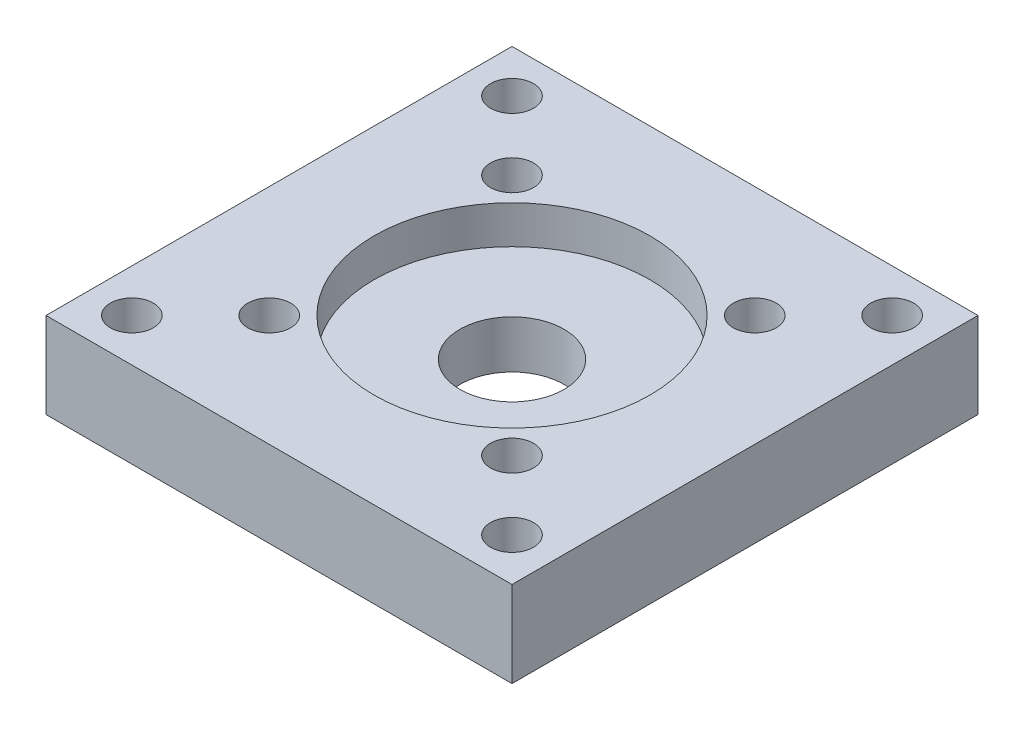
ISO-10303-21;
HEADER;
FILE_DESCRIPTION(('STEP AP214'),'2;1');
FILE_NAME('part.step','',(''),(''),'','','');
FILE_SCHEMA(('AUTOMOTIVE_DESIGN { 1 0 10303 214 1 1 1 1 }'));
ENDSEC;
DATA;
#1=APPLICATION_CONTEXT('core data for automotive mechanical design processes');
#2=APPLICATION_PROTOCOL_DEFINITION('international standard','automotive_design',2000,#1);
#3=PRODUCT_CONTEXT('',#1,'mechanical');
#4=PRODUCT('Part','Part','',(#3));
#5=PRODUCT_RELATED_PRODUCT_CATEGORY('part','',(#4));
#6=PRODUCT_DEFINITION_FORMATION('','',#4);
#7=PRODUCT_DEFINITION_CONTEXT('part definition',#1,'design');
#8=PRODUCT_DEFINITION('design','',#6,#7);
#9=PRODUCT_DEFINITION_SHAPE('','',#8);
#10=(LENGTH_UNIT() NAMED_UNIT(*) SI_UNIT(.MILLI.,.METRE.));
#11=(NAMED_UNIT(*) PLANE_ANGLE_UNIT() SI_UNIT($,.RADIAN.));
#12=(NAMED_UNIT(*) SI_UNIT($,.STERADIAN.) SOLID_ANGLE_UNIT());
#13=UNCERTAINTY_MEASURE_WITH_UNIT(LENGTH_MEASURE(1.E-05),#10,'distance_accuracy_value','');
#14=(GEOMETRIC_REPRESENTATION_CONTEXT(3) GLOBAL_UNCERTAINTY_ASSIGNED_CONTEXT((#13)) GLOBAL_UNIT_ASSIGNED_CONTEXT((#10,
#11,#12)) REPRESENTATION_CONTEXT('',''));
#15=CARTESIAN_POINT('',(0.,0.,0.));
#16=DIRECTION('',(0.,0.,1.));
#17=DIRECTION('',(1.,0.,0.));
#18=AXIS2_PLACEMENT_3D('',#15,#16,#17);
#19=CARTESIAN_POINT('',(-9.89949493661172,-20.,-9.89949493661161));
#20=DIRECTION('',(0.,1.,0.));
#21=DIRECTION('',(0.,0.,1.));
#22=AXIS2_PLACEMENT_3D('',#19,#20,#21);
#23=CYLINDRICAL_SURFACE('',#22,1.75);
#24=CARTESIAN_POINT('',(-9.89949493661172,7.,-9.89949493661161));
#25=DIRECTION('',(0.,1.,0.));
#26=DIRECTION('',(0.,0.,1.));
#27=AXIS2_PLACEMENT_3D('',#24,#25,#26);
#28=CIRCLE('',#27,1.75);
#29=CARTESIAN_POINT('',(-9.89949493661172,7.,-8.14949493661161));
#30=VERTEX_POINT('',#29);
#31=EDGE_CURVE('E147',#30,#30,#28,.T.);
#32=ORIENTED_EDGE('',*,*,#31,.T.);
#33=EDGE_LOOP('',(#32));
#34=FACE_BOUND('',#33,.T.);
#35=CARTESIAN_POINT('',(-9.89949493661172,3.5,-9.89949493661161));
#36=DIRECTION('',(0.,-1.,0.));
#37=DIRECTION('',(0.,0.,-1.));
#38=AXIS2_PLACEMENT_3D('',#35,#36,#37);
#39=CIRCLE('',#38,1.75);
#40=CARTESIAN_POINT('',(-9.89949493661172,3.5,-11.6494949366116));
#41=VERTEX_POINT('',#40);
#42=EDGE_CURVE('E171',#41,#41,#39,.T.);
#43=ORIENTED_EDGE('',*,*,#42,.T.);
#44=EDGE_LOOP('',(#43));
#45=FACE_BOUND('',#44,.T.);
#46=ADVANCED_FACE('F37',(#34,#45),#23,.F.);
#47=CARTESIAN_POINT('',(9.89949493661165,-20.,-9.89949493661168));
#48=DIRECTION('',(0.,1.,0.));
#49=DIRECTION('',(0.,0.,1.));
#50=AXIS2_PLACEMENT_3D('',#47,#48,#49);
#51=CYLINDRICAL_SURFACE('',#50,1.75);
#52=CARTESIAN_POINT('',(9.89949493661165,7.,-9.89949493661168));
#53=DIRECTION('',(0.,1.,0.));
#54=DIRECTION('',(0.,0.,1.));
#55=AXIS2_PLACEMENT_3D('',#52,#53,#54);
#56=CIRCLE('',#55,1.75);
#57=CARTESIAN_POINT('',(9.89949493661165,7.,-8.14949493661168));
#58=VERTEX_POINT('',#57);
#59=EDGE_CURVE('E152',#58,#58,#56,.T.);
#60=ORIENTED_EDGE('',*,*,#59,.T.);
#61=EDGE_LOOP('',(#60));
#62=FACE_BOUND('',#61,.T.);
#63=CARTESIAN_POINT('',(9.89949493661165,3.5,-9.89949493661168));
#64=DIRECTION('',(0.,-1.,0.));
#65=DIRECTION('',(0.,0.,-1.));
#66=AXIS2_PLACEMENT_3D('',#63,#64,#65);
#67=CIRCLE('',#66,1.75);
#68=CARTESIAN_POINT('',(9.89949493661165,3.5,-11.6494949366117));
#69=VERTEX_POINT('',#68);
#70=EDGE_CURVE('E181',#69,#69,#67,.T.);
#71=ORIENTED_EDGE('',*,*,#70,.T.);
#72=EDGE_LOOP('',(#71));
#73=FACE_BOUND('',#72,.T.);
#74=ADVANCED_FACE('F235',(#62,#73),#51,.F.);
#75=CARTESIAN_POINT('',(9.89949493661179,-20.,9.89949493661154));
#76=DIRECTION('',(0.,1.,0.));
#77=DIRECTION('',(0.,0.,1.));
#78=AXIS2_PLACEMENT_3D('',#75,#76,#77);
#79=CYLINDRICAL_SURFACE('',#78,1.75);
#80=CARTESIAN_POINT('',(9.89949493661179,7.,9.89949493661154));
#81=DIRECTION('',(0.,1.,0.));
#82=DIRECTION('',(0.,0.,1.));
#83=AXIS2_PLACEMENT_3D('',#80,#81,#82);
#84=CIRCLE('',#83,1.75);
#85=CARTESIAN_POINT('',(9.89949493661179,7.,11.6494949366115));
#86=VERTEX_POINT('',#85);
#87=EDGE_CURVE('E156',#86,#86,#84,.T.);
#88=ORIENTED_EDGE('',*,*,#87,.T.);
#89=EDGE_LOOP('',(#88));
#90=FACE_BOUND('',#89,.T.);
#91=CARTESIAN_POINT('',(9.89949493661179,3.5,9.89949493661154));
#92=DIRECTION('',(0.,-1.,0.));
#93=DIRECTION('',(0.,0.,-1.));
#94=AXIS2_PLACEMENT_3D('',#91,#92,#93);
#95=CIRCLE('',#94,1.75);
#96=CARTESIAN_POINT('',(9.89949493661179,3.5,8.14949493661155));
#97=VERTEX_POINT('',#96);
#98=EDGE_CURVE('E170',#97,#97,#95,.T.);
#99=ORIENTED_EDGE('',*,*,#98,.T.);
#100=EDGE_LOOP('',(#99));
#101=FACE_BOUND('',#100,.T.);
#102=ADVANCED_FACE('F241',(#90,#101),#79,.F.);
#103=CARTESIAN_POINT('',(-9.89949493661158,-20.,9.89949493661175));
#104=DIRECTION('',(0.,1.,0.));
#105=DIRECTION('',(0.,0.,1.));
#106=AXIS2_PLACEMENT_3D('',#103,#104,#105);
#107=CYLINDRICAL_SURFACE('',#106,1.75);
#108=CARTESIAN_POINT('',(-9.89949493661158,7.,9.89949493661175));
#109=DIRECTION('',(0.,1.,0.));
#110=DIRECTION('',(0.,0.,1.));
#111=AXIS2_PLACEMENT_3D('',#108,#109,#110);
#112=CIRCLE('',#111,1.75);
#113=CARTESIAN_POINT('',(-9.89949493661158,7.,11.6494949366118));
#114=VERTEX_POINT('',#113);
#115=EDGE_CURVE('E153',#114,#114,#112,.T.);
#116=ORIENTED_EDGE('',*,*,#115,.T.);
#117=EDGE_LOOP('',(#116));
#118=FACE_BOUND('',#117,.T.);
#119=CARTESIAN_POINT('',(-9.89949493661158,3.5,9.89949493661175));
#120=DIRECTION('',(0.,-1.,0.));
#121=DIRECTION('',(0.,0.,-1.));
#122=AXIS2_PLACEMENT_3D('',#119,#120,#121);
#123=CIRCLE('',#122,1.75);
#124=CARTESIAN_POINT('',(-9.89949493661158,3.5,8.14949493661175));
#125=VERTEX_POINT('',#124);
#126=EDGE_CURVE('E165',#125,#125,#123,.T.);
#127=ORIENTED_EDGE('',*,*,#126,.T.);
#128=EDGE_LOOP('',(#127));
#129=FACE_BOUND('',#128,.T.);
#130=ADVANCED_FACE('F247',(#118,#129),#107,.F.);
#131=CARTESIAN_POINT('',(0.,0.,0.));
#132=DIRECTION('',(0.,1.,0.));
#133=DIRECTION('',(0.,0.,1.));
#134=AXIS2_PLACEMENT_3D('',#131,#132,#133);
#135=CYLINDRICAL_SURFACE('',#134,4.25);
#136=CARTESIAN_POINT('',(0.,0.,0.));
#137=DIRECTION('',(0.,1.,0.));
#138=DIRECTION('',(0.,0.,1.));
#139=AXIS2_PLACEMENT_3D('',#136,#137,#138);
#140=CIRCLE('',#139,4.25);
#141=CARTESIAN_POINT('',(0.,0.,4.24999999999999));
#142=VERTEX_POINT('',#141);
#143=EDGE_CURVE('E123',#142,#142,#140,.T.);
#144=ORIENTED_EDGE('',*,*,#143,.F.);
#145=EDGE_LOOP('',(#144));
#146=FACE_BOUND('',#145,.T.);
#147=CARTESIAN_POINT('',(0.,3.9,0.));
#148=DIRECTION('',(0.,1.,0.));
#149=DIRECTION('',(0.,0.,1.));
#150=AXIS2_PLACEMENT_3D('',#147,#148,#149);
#151=CIRCLE('',#150,4.25);
#152=CARTESIAN_POINT('',(0.,3.9,4.24999999999999));
#153=VERTEX_POINT('',#152);
#154=EDGE_CURVE('E41',#153,#153,#151,.F.);
#155=ORIENTED_EDGE('',*,*,#154,.F.);
#156=EDGE_LOOP('',(#155));
#157=FACE_BOUND('',#156,.T.);
#158=ADVANCED_FACE('F269',(#146,#157),#135,.F.);
#159=CARTESIAN_POINT('',(19.,7.,19.));
#160=DIRECTION('',(-1.,0.,0.));
#161=DIRECTION('',(0.,0.,1.));
#162=AXIS2_PLACEMENT_3D('',#159,#160,#161);
#163=PLANE('',#162);
#164=DIRECTION('',(0.,0.,-1.));
#165=VECTOR('',#164,1.);
#166=CARTESIAN_POINT('',(19.,0.,19.));
#167=LINE('',#166,#165);
#168=CARTESIAN_POINT('',(19.,0.,19.));
#169=VERTEX_POINT('',#168);
#170=CARTESIAN_POINT('',(19.,0.,-19.));
#171=VERTEX_POINT('',#170);
#172=EDGE_CURVE('E103',#169,#171,#167,.T.);
#173=ORIENTED_EDGE('',*,*,#172,.T.);
#174=DIRECTION('',(0.,-1.,0.));
#175=VECTOR('',#174,1.);
#176=CARTESIAN_POINT('',(19.,7.,-19.));
#177=LINE('',#176,#175);
#178=CARTESIAN_POINT('',(19.,7.,-19.));
#179=VERTEX_POINT('',#178);
#180=EDGE_CURVE('E11',#179,#171,#177,.T.);
#181=ORIENTED_EDGE('',*,*,#180,.F.);
#182=DIRECTION('',(0.,0.,-1.));
#183=VECTOR('',#182,1.);
#184=CARTESIAN_POINT('',(19.,7.,19.));
#185=LINE('',#184,#183);
#186=CARTESIAN_POINT('',(19.,7.,19.));
#187=VERTEX_POINT('',#186);
#188=EDGE_CURVE('E90',#187,#179,#185,.T.);
#189=ORIENTED_EDGE('',*,*,#188,.F.);
#190=DIRECTION('',(0.,-1.,0.));
#191=VECTOR('',#190,1.);
#192=CARTESIAN_POINT('',(19.,7.,19.));
#193=LINE('',#192,#191);
#194=EDGE_CURVE('E99',#187,#169,#193,.T.);
#195=ORIENTED_EDGE('',*,*,#194,.T.);
#196=EDGE_LOOP('',(#173,#181,#189,#195));
#197=FACE_BOUND('',#196,.T.);
#198=ADVANCED_FACE('F39',(#197),#163,.F.);
#199=CARTESIAN_POINT('',(-19.,7.,-19.));
#200=DIRECTION('',(0.,0.,1.));
#201=DIRECTION('',(1.,0.,0.));
#202=AXIS2_PLACEMENT_3D('',#199,#200,#201);
#203=PLANE('',#202);
#204=DIRECTION('',(-1.,0.,0.));
#205=VECTOR('',#204,1.);
#206=CARTESIAN_POINT('',(-19.,0.,-19.));
#207=LINE('',#206,#205);
#208=CARTESIAN_POINT('',(-19.,0.,-19.));
#209=VERTEX_POINT('',#208);
#210=EDGE_CURVE('E94',#171,#209,#207,.T.);
#211=ORIENTED_EDGE('',*,*,#210,.T.);
#212=DIRECTION('',(0.,-1.,0.));
#213=VECTOR('',#212,1.);
#214=CARTESIAN_POINT('',(-19.,7.,-19.));
#215=LINE('',#214,#213);
#216=CARTESIAN_POINT('',(-19.,7.,-19.));
#217=VERTEX_POINT('',#216);
#218=EDGE_CURVE('E47',#217,#209,#215,.T.);
#219=ORIENTED_EDGE('',*,*,#218,.F.);
#220=DIRECTION('',(-1.,0.,0.));
#221=VECTOR('',#220,1.);
#222=CARTESIAN_POINT('',(-19.,7.,-19.));
#223=LINE('',#222,#221);
#224=EDGE_CURVE('E85',#179,#217,#223,.T.);
#225=ORIENTED_EDGE('',*,*,#224,.F.);
#226=ORIENTED_EDGE('',*,*,#180,.T.);
#227=EDGE_LOOP('',(#211,#219,#225,#226));
#228=FACE_BOUND('',#227,.T.);
#229=ADVANCED_FACE('F93',(#228),#203,.F.);
#230=CARTESIAN_POINT('',(-19.,7.,19.));
#231=DIRECTION('',(1.,0.,0.));
#232=DIRECTION('',(0.,0.,-1.));
#233=AXIS2_PLACEMENT_3D('',#230,#231,#232);
#234=PLANE('',#233);
#235=DIRECTION('',(0.,0.,1.));
#236=VECTOR('',#235,1.);
#237=CARTESIAN_POINT('',(-19.,0.,19.));
#238=LINE('',#237,#236);
#239=CARTESIAN_POINT('',(-19.,0.,19.));
#240=VERTEX_POINT('',#239);
#241=EDGE_CURVE('E72',#209,#240,#238,.T.);
#242=ORIENTED_EDGE('',*,*,#241,.T.);
#243=DIRECTION('',(0.,-1.,0.));
#244=VECTOR('',#243,1.);
#245=CARTESIAN_POINT('',(-19.,7.,19.));
#246=LINE('',#245,#244);
#247=CARTESIAN_POINT('',(-19.,7.,19.));
#248=VERTEX_POINT('',#247);
#249=EDGE_CURVE('E95',#248,#240,#246,.T.);
#250=ORIENTED_EDGE('',*,*,#249,.F.);
#251=DIRECTION('',(0.,0.,1.));
#252=VECTOR('',#251,1.);
#253=CARTESIAN_POINT('',(-19.,7.,19.));
#254=LINE('',#253,#252);
#255=EDGE_CURVE('E88',#217,#248,#254,.T.);
#256=ORIENTED_EDGE('',*,*,#255,.F.);
#257=ORIENTED_EDGE('',*,*,#218,.T.);
#258=EDGE_LOOP('',(#242,#250,#256,#257));
#259=FACE_BOUND('',#258,.T.);
#260=ADVANCED_FACE('F97',(#259),#234,.F.);
#261=CARTESIAN_POINT('',(-19.,7.,19.));
#262=DIRECTION('',(0.,0.,-1.));
#263=DIRECTION('',(-1.,0.,0.));
#264=AXIS2_PLACEMENT_3D('',#261,#262,#263);
#265=PLANE('',#264);
#266=DIRECTION('',(1.,0.,0.));
#267=VECTOR('',#266,1.);
#268=CARTESIAN_POINT('',(-19.,0.,19.));
#269=LINE('',#268,#267);
#270=EDGE_CURVE('E78',#240,#169,#269,.T.);
#271=ORIENTED_EDGE('',*,*,#270,.T.);
#272=ORIENTED_EDGE('',*,*,#194,.F.);
#273=DIRECTION('',(1.,0.,0.));
#274=VECTOR('',#273,1.);
#275=CARTESIAN_POINT('',(-19.,7.,19.));
#276=LINE('',#275,#274);
#277=EDGE_CURVE('E55',#248,#187,#276,.T.);
#278=ORIENTED_EDGE('',*,*,#277,.F.);
#279=ORIENTED_EDGE('',*,*,#249,.T.);
#280=EDGE_LOOP('',(#271,#272,#278,#279));
#281=FACE_BOUND('',#280,.T.);
#282=ADVANCED_FACE('F111',(#281),#265,.F.);
#283=CARTESIAN_POINT('',(0.,7.,0.));
#284=DIRECTION('',(0.,-1.,0.));
#285=DIRECTION('',(0.,0.,-1.));
#286=AXIS2_PLACEMENT_3D('',#283,#284,#285);
#287=PLANE('',#286);
#288=ORIENTED_EDGE('',*,*,#115,.F.);
#289=EDGE_LOOP('',(#288));
#290=FACE_BOUND('',#289,.T.);
#291=ORIENTED_EDGE('',*,*,#87,.F.);
#292=EDGE_LOOP('',(#291));
#293=FACE_BOUND('',#292,.T.);
#294=ORIENTED_EDGE('',*,*,#59,.F.);
#295=EDGE_LOOP('',(#294));
#296=FACE_BOUND('',#295,.T.);
#297=ORIENTED_EDGE('',*,*,#31,.F.);
#298=EDGE_LOOP('',(#297));
#299=FACE_BOUND('',#298,.T.);
#300=CARTESIAN_POINT('',(0.,7.,0.));
#301=DIRECTION('',(0.,1.,0.));
#302=DIRECTION('',(0.,0.,1.));
#303=AXIS2_PLACEMENT_3D('',#300,#301,#302);
#304=CIRCLE('',#303,11.25);
#305=CARTESIAN_POINT('',(0.,7.,11.25));
#306=VERTEX_POINT('',#305);
#307=EDGE_CURVE('E143',#306,#306,#304,.T.);
#308=ORIENTED_EDGE('',*,*,#307,.F.);
#309=EDGE_LOOP('',(#308));
#310=FACE_BOUND('',#309,.T.);
#311=CARTESIAN_POINT('',(15.5,7.,-15.5));
#312=DIRECTION('',(0.,1.,0.));
#313=DIRECTION('',(0.,0.,1.));
#314=AXIS2_PLACEMENT_3D('',#311,#312,#313);
#315=CIRCLE('',#314,1.75);
#316=CARTESIAN_POINT('',(15.5,7.,-13.75));
#317=VERTEX_POINT('',#316);
#318=EDGE_CURVE('E129',#317,#317,#315,.T.);
#319=ORIENTED_EDGE('',*,*,#318,.F.);
#320=EDGE_LOOP('',(#319));
#321=FACE_BOUND('',#320,.T.);
#322=CARTESIAN_POINT('',(15.5,7.,15.5));
#323=DIRECTION('',(0.,1.,0.));
#324=DIRECTION('',(0.,0.,1.));
#325=AXIS2_PLACEMENT_3D('',#322,#323,#324);
#326=CIRCLE('',#325,1.75);
#327=CARTESIAN_POINT('',(15.5,7.,17.25));
#328=VERTEX_POINT('',#327);
#329=EDGE_CURVE('E135',#328,#328,#326,.T.);
#330=ORIENTED_EDGE('',*,*,#329,.F.);
#331=EDGE_LOOP('',(#330));
#332=FACE_BOUND('',#331,.T.);
#333=CARTESIAN_POINT('',(-15.5,7.,15.5));
#334=DIRECTION('',(0.,1.,0.));
#335=DIRECTION('',(0.,0.,1.));
#336=AXIS2_PLACEMENT_3D('',#333,#334,#335);
#337=CIRCLE('',#336,1.75);
#338=CARTESIAN_POINT('',(-15.5,7.,17.25));
#339=VERTEX_POINT('',#338);
#340=EDGE_CURVE('E120',#339,#339,#337,.T.);
#341=ORIENTED_EDGE('',*,*,#340,.F.);
#342=EDGE_LOOP('',(#341));
#343=FACE_BOUND('',#342,.T.);
#344=CARTESIAN_POINT('',(-15.5,7.,-15.5));
#345=DIRECTION('',(0.,1.,0.));
#346=DIRECTION('',(0.,0.,1.));
#347=AXIS2_PLACEMENT_3D('',#344,#345,#346);
#348=CIRCLE('',#347,1.75);
#349=CARTESIAN_POINT('',(-15.5,7.,-13.75));
#350=VERTEX_POINT('',#349);
#351=EDGE_CURVE('E117',#350,#350,#348,.T.);
#352=ORIENTED_EDGE('',*,*,#351,.F.);
#353=EDGE_LOOP('',(#352));
#354=FACE_BOUND('',#353,.T.);
#355=ORIENTED_EDGE('',*,*,#188,.T.);
#356=ORIENTED_EDGE('',*,*,#224,.T.);
#357=ORIENTED_EDGE('',*,*,#255,.T.);
#358=ORIENTED_EDGE('',*,*,#277,.T.);
#359=EDGE_LOOP('',(#355,#356,#357,#358));
#360=FACE_BOUND('',#359,.T.);
#361=ADVANCED_FACE('F86',(#290,#293,#296,#299,#310,#321,#332,#343,#354,#360),#287,.F.);
#362=CARTESIAN_POINT('',(0.,0.,0.));
#363=DIRECTION('',(0.,-1.,0.));
#364=DIRECTION('',(0.,0.,-1.));
#365=AXIS2_PLACEMENT_3D('',#362,#363,#364);
#366=PLANE('',#365);
#367=CARTESIAN_POINT('',(-9.89949493661172,0.,-9.89949493661161));
#368=DIRECTION('',(0.,-1.,0.));
#369=DIRECTION('',(0.,0.,-1.));
#370=AXIS2_PLACEMENT_3D('',#367,#368,#369);
#371=CIRCLE('',#370,2.75);
#372=CARTESIAN_POINT('',(-9.89949493661172,0.,-12.6494949366116));
#373=VERTEX_POINT('',#372);
#374=EDGE_CURVE('E175',#373,#373,#371,.T.);
#375=ORIENTED_EDGE('',*,*,#374,.F.);
#376=EDGE_LOOP('',(#375));
#377=FACE_BOUND('',#376,.T.);
#378=CARTESIAN_POINT('',(9.89949493661165,0.,-9.89949493661168));
#379=DIRECTION('',(0.,-1.,0.));
#380=DIRECTION('',(0.,0.,-1.));
#381=AXIS2_PLACEMENT_3D('',#378,#379,#380);
#382=CIRCLE('',#381,2.75);
#383=CARTESIAN_POINT('',(9.89949493661165,0.,-12.6494949366117));
#384=VERTEX_POINT('',#383);
#385=EDGE_CURVE('E185',#384,#384,#382,.T.);
#386=ORIENTED_EDGE('',*,*,#385,.F.);
#387=EDGE_LOOP('',(#386));
#388=FACE_BOUND('',#387,.T.);
#389=CARTESIAN_POINT('',(9.89949493661179,0.,9.89949493661154));
#390=DIRECTION('',(0.,-1.,0.));
#391=DIRECTION('',(0.,0.,-1.));
#392=AXIS2_PLACEMENT_3D('',#389,#390,#391);
#393=CIRCLE('',#392,2.75);
#394=CARTESIAN_POINT('',(9.89949493661179,0.,7.14949493661155));
#395=VERTEX_POINT('',#394);
#396=EDGE_CURVE('E192',#395,#395,#393,.T.);
#397=ORIENTED_EDGE('',*,*,#396,.F.);
#398=EDGE_LOOP('',(#397));
#399=FACE_BOUND('',#398,.T.);
#400=CARTESIAN_POINT('',(-9.89949493661158,0.,9.89949493661175));
#401=DIRECTION('',(0.,-1.,0.));
#402=DIRECTION('',(0.,0.,-1.));
#403=AXIS2_PLACEMENT_3D('',#400,#401,#402);
#404=CIRCLE('',#403,2.75);
#405=CARTESIAN_POINT('',(-9.89949493661158,0.,7.14949493661175));
#406=VERTEX_POINT('',#405);
#407=EDGE_CURVE('E162',#406,#406,#404,.T.);
#408=ORIENTED_EDGE('',*,*,#407,.F.);
#409=EDGE_LOOP('',(#408));
#410=FACE_BOUND('',#409,.T.);
#411=ORIENTED_EDGE('',*,*,#143,.T.);
#412=EDGE_LOOP('',(#411));
#413=FACE_BOUND('',#412,.T.);
#414=CARTESIAN_POINT('',(15.5,0.,-15.5));
#415=DIRECTION('',(0.,1.,0.));
#416=DIRECTION('',(0.,0.,1.));
#417=AXIS2_PLACEMENT_3D('',#414,#415,#416);
#418=CIRCLE('',#417,1.75);
#419=CARTESIAN_POINT('',(15.5,0.,-13.75));
#420=VERTEX_POINT('',#419);
#421=EDGE_CURVE('E126',#420,#420,#418,.T.);
#422=ORIENTED_EDGE('',*,*,#421,.T.);
#423=EDGE_LOOP('',(#422));
#424=FACE_BOUND('',#423,.T.);
#425=CARTESIAN_POINT('',(15.5,0.,15.5));
#426=DIRECTION('',(0.,1.,0.));
#427=DIRECTION('',(0.,0.,1.));
#428=AXIS2_PLACEMENT_3D('',#425,#426,#427);
#429=CIRCLE('',#428,1.75);
#430=CARTESIAN_POINT('',(15.5,0.,17.25));
#431=VERTEX_POINT('',#430);
#432=EDGE_CURVE('E132',#431,#431,#429,.T.);
#433=ORIENTED_EDGE('',*,*,#432,.T.);
#434=EDGE_LOOP('',(#433));
#435=FACE_BOUND('',#434,.T.);
#436=CARTESIAN_POINT('',(-15.5,0.,15.5));
#437=DIRECTION('',(0.,1.,0.));
#438=DIRECTION('',(0.,0.,1.));
#439=AXIS2_PLACEMENT_3D('',#436,#437,#438);
#440=CIRCLE('',#439,1.75);
#441=CARTESIAN_POINT('',(-15.5,0.,17.25));
#442=VERTEX_POINT('',#441);
#443=EDGE_CURVE('E138',#442,#442,#440,.T.);
#444=ORIENTED_EDGE('',*,*,#443,.T.);
#445=EDGE_LOOP('',(#444));
#446=FACE_BOUND('',#445,.T.);
#447=CARTESIAN_POINT('',(-15.5,0.,-15.5));
#448=DIRECTION('',(0.,1.,0.));
#449=DIRECTION('',(0.,0.,1.));
#450=AXIS2_PLACEMENT_3D('',#447,#448,#449);
#451=CIRCLE('',#450,1.75);
#452=CARTESIAN_POINT('',(-15.5,0.,-13.75));
#453=VERTEX_POINT('',#452);
#454=EDGE_CURVE('E106',#453,#453,#451,.T.);
#455=ORIENTED_EDGE('',*,*,#454,.T.);
#456=EDGE_LOOP('',(#455));
#457=FACE_BOUND('',#456,.T.);
#458=ORIENTED_EDGE('',*,*,#172,.F.);
#459=ORIENTED_EDGE('',*,*,#270,.F.);
#460=ORIENTED_EDGE('',*,*,#241,.F.);
#461=ORIENTED_EDGE('',*,*,#210,.F.);
#462=EDGE_LOOP('',(#458,#459,#460,#461));
#463=FACE_BOUND('',#462,.T.);
#464=ADVANCED_FACE('F114',(#377,#388,#399,#410,#413,#424,#435,#446,#457,#463),#366,.T.);
#465=CARTESIAN_POINT('',(-15.5,0.,-15.5));
#466=DIRECTION('',(0.,1.,0.));
#467=DIRECTION('',(0.,0.,1.));
#468=AXIS2_PLACEMENT_3D('',#465,#466,#467);
#469=CYLINDRICAL_SURFACE('',#468,1.75);
#470=ORIENTED_EDGE('',*,*,#454,.F.);
#471=EDGE_LOOP('',(#470));
#472=FACE_BOUND('',#471,.T.);
#473=ORIENTED_EDGE('',*,*,#351,.T.);
#474=EDGE_LOOP('',(#473));
#475=FACE_BOUND('',#474,.T.);
#476=ADVANCED_FACE('F202',(#472,#475),#469,.F.);
#477=CARTESIAN_POINT('',(-15.5,0.,15.5));
#478=DIRECTION('',(0.,1.,0.));
#479=DIRECTION('',(0.,0.,1.));
#480=AXIS2_PLACEMENT_3D('',#477,#478,#479);
#481=CYLINDRICAL_SURFACE('',#480,1.75);
#482=ORIENTED_EDGE('',*,*,#443,.F.);
#483=EDGE_LOOP('',(#482));
#484=FACE_BOUND('',#483,.T.);
#485=ORIENTED_EDGE('',*,*,#340,.T.);
#486=EDGE_LOOP('',(#485));
#487=FACE_BOUND('',#486,.T.);
#488=ADVANCED_FACE('F219',(#484,#487),#481,.F.);
#489=CARTESIAN_POINT('',(15.5,0.,15.5));
#490=DIRECTION('',(0.,1.,0.));
#491=DIRECTION('',(0.,0.,1.));
#492=AXIS2_PLACEMENT_3D('',#489,#490,#491);
#493=CYLINDRICAL_SURFACE('',#492,1.75);
#494=ORIENTED_EDGE('',*,*,#432,.F.);
#495=EDGE_LOOP('',(#494));
#496=FACE_BOUND('',#495,.T.);
#497=ORIENTED_EDGE('',*,*,#329,.T.);
#498=EDGE_LOOP('',(#497));
#499=FACE_BOUND('',#498,.T.);
#500=ADVANCED_FACE('F261',(#496,#499),#493,.F.);
#501=CARTESIAN_POINT('',(15.5,0.,-15.5));
#502=DIRECTION('',(0.,1.,0.));
#503=DIRECTION('',(0.,0.,1.));
#504=AXIS2_PLACEMENT_3D('',#501,#502,#503);
#505=CYLINDRICAL_SURFACE('',#504,1.75);
#506=ORIENTED_EDGE('',*,*,#421,.F.);
#507=EDGE_LOOP('',(#506));
#508=FACE_BOUND('',#507,.T.);
#509=ORIENTED_EDGE('',*,*,#318,.T.);
#510=EDGE_LOOP('',(#509));
#511=FACE_BOUND('',#510,.T.);
#512=ADVANCED_FACE('F253',(#508,#511),#505,.F.);
#513=CARTESIAN_POINT('',(0.,3.9,0.));
#514=DIRECTION('',(0.,1.,0.));
#515=DIRECTION('',(0.,0.,1.));
#516=AXIS2_PLACEMENT_3D('',#513,#514,#515);
#517=PLANE('',#516);
#518=CARTESIAN_POINT('',(0.,3.9,0.));
#519=DIRECTION('',(0.,1.,0.));
#520=DIRECTION('',(0.,0.,1.));
#521=AXIS2_PLACEMENT_3D('',#518,#519,#520);
#522=CIRCLE('',#521,11.25);
#523=CARTESIAN_POINT('',(0.,3.9,11.25));
#524=VERTEX_POINT('',#523);
#525=EDGE_CURVE('E146',#524,#524,#522,.T.);
#526=ORIENTED_EDGE('',*,*,#525,.T.);
#527=EDGE_LOOP('',(#526));
#528=FACE_BOUND('',#527,.T.);
#529=ORIENTED_EDGE('',*,*,#154,.T.);
#530=EDGE_LOOP('',(#529));
#531=FACE_BOUND('',#530,.T.);
#532=ADVANCED_FACE('F249',(#528,#531),#517,.T.);
#533=CARTESIAN_POINT('',(0.,3.9,0.));
#534=DIRECTION('',(0.,1.,0.));
#535=DIRECTION('',(0.,0.,1.));
#536=AXIS2_PLACEMENT_3D('',#533,#534,#535);
#537=CYLINDRICAL_SURFACE('',#536,11.25);
#538=ORIENTED_EDGE('',*,*,#525,.F.);
#539=EDGE_LOOP('',(#538));
#540=FACE_BOUND('',#539,.T.);
#541=ORIENTED_EDGE('',*,*,#307,.T.);
#542=EDGE_LOOP('',(#541));
#543=FACE_BOUND('',#542,.T.);
#544=ADVANCED_FACE('F252',(#540,#543),#537,.F.);
#545=CARTESIAN_POINT('',(-9.89949493661158,3.5,9.89949493661175));
#546=DIRECTION('',(0.,-1.,0.));
#547=DIRECTION('',(0.,0.,-1.));
#548=AXIS2_PLACEMENT_3D('',#545,#546,#547);
#549=CYLINDRICAL_SURFACE('',#548,2.75);
#550=CARTESIAN_POINT('',(-9.89949493661158,3.5,9.89949493661175));
#551=DIRECTION('',(0.,-1.,0.));
#552=DIRECTION('',(0.,0.,-1.));
#553=AXIS2_PLACEMENT_3D('',#550,#551,#552);
#554=CIRCLE('',#553,2.75);
#555=CARTESIAN_POINT('',(-9.89949493661158,3.5,7.14949493661175));
#556=VERTEX_POINT('',#555);
#557=EDGE_CURVE('E157',#556,#556,#554,.T.);
#558=ORIENTED_EDGE('',*,*,#557,.F.);
#559=EDGE_LOOP('',(#558));
#560=FACE_BOUND('',#559,.T.);
#561=ORIENTED_EDGE('',*,*,#407,.T.);
#562=EDGE_LOOP('',(#561));
#563=FACE_BOUND('',#562,.T.);
#564=ADVANCED_FACE('F257',(#560,#563),#549,.F.);
#565=CARTESIAN_POINT('',(-9.89949493661158,3.5,9.89949493661175));
#566=DIRECTION('',(0.,-1.,0.));
#567=DIRECTION('',(0.,0.,-1.));
#568=AXIS2_PLACEMENT_3D('',#565,#566,#567);
#569=PLANE('',#568);
#570=ORIENTED_EDGE('',*,*,#126,.F.);
#571=EDGE_LOOP('',(#570));
#572=FACE_BOUND('',#571,.T.);
#573=ORIENTED_EDGE('',*,*,#557,.T.);
#574=EDGE_LOOP('',(#573));
#575=FACE_BOUND('',#574,.T.);
#576=ADVANCED_FACE('F288',(#572,#575),#569,.T.);
#577=CARTESIAN_POINT('',(9.89949493661179,3.5,9.89949493661154));
#578=DIRECTION('',(0.,-1.,0.));
#579=DIRECTION('',(0.,0.,-1.));
#580=AXIS2_PLACEMENT_3D('',#577,#578,#579);
#581=CYLINDRICAL_SURFACE('',#580,2.75);
#582=CARTESIAN_POINT('',(9.89949493661179,3.5,9.89949493661154));
#583=DIRECTION('',(0.,-1.,0.));
#584=DIRECTION('',(0.,0.,-1.));
#585=AXIS2_PLACEMENT_3D('',#582,#583,#584);
#586=CIRCLE('',#585,2.75);
#587=CARTESIAN_POINT('',(9.89949493661179,3.5,7.14949493661155));
#588=VERTEX_POINT('',#587);
#589=EDGE_CURVE('E184',#588,#588,#586,.T.);
#590=ORIENTED_EDGE('',*,*,#589,.F.);
#591=EDGE_LOOP('',(#590));
#592=FACE_BOUND('',#591,.T.);
#593=ORIENTED_EDGE('',*,*,#396,.T.);
#594=EDGE_LOOP('',(#593));
#595=FACE_BOUND('',#594,.T.);
#596=ADVANCED_FACE('F198',(#592,#595),#581,.F.);
#597=CARTESIAN_POINT('',(9.89949493661179,3.5,9.89949493661154));
#598=DIRECTION('',(0.,-1.,0.));
#599=DIRECTION('',(0.,0.,-1.));
#600=AXIS2_PLACEMENT_3D('',#597,#598,#599);
#601=PLANE('',#600);
#602=ORIENTED_EDGE('',*,*,#98,.F.);
#603=EDGE_LOOP('',(#602));
#604=FACE_BOUND('',#603,.T.);
#605=ORIENTED_EDGE('',*,*,#589,.T.);
#606=EDGE_LOOP('',(#605));
#607=FACE_BOUND('',#606,.T.);
#608=ADVANCED_FACE('F315',(#604,#607),#601,.T.);
#609=CARTESIAN_POINT('',(9.89949493661165,3.5,-9.89949493661168));
#610=DIRECTION('',(0.,-1.,0.));
#611=DIRECTION('',(0.,0.,-1.));
#612=AXIS2_PLACEMENT_3D('',#609,#610,#611);
#613=CYLINDRICAL_SURFACE('',#612,2.75);
#614=CARTESIAN_POINT('',(9.89949493661165,3.5,-9.89949493661168));
#615=DIRECTION('',(0.,-1.,0.));
#616=DIRECTION('',(0.,0.,-1.));
#617=AXIS2_PLACEMENT_3D('',#614,#615,#616);
#618=CIRCLE('',#617,2.75);
#619=CARTESIAN_POINT('',(9.89949493661165,3.5,-12.6494949366117));
#620=VERTEX_POINT('',#619);
#621=EDGE_CURVE('E174',#620,#620,#618,.T.);
#622=ORIENTED_EDGE('',*,*,#621,.F.);
#623=EDGE_LOOP('',(#622));
#624=FACE_BOUND('',#623,.T.);
#625=ORIENTED_EDGE('',*,*,#385,.T.);
#626=EDGE_LOOP('',(#625));
#627=FACE_BOUND('',#626,.T.);
#628=ADVANCED_FACE('F311',(#624,#627),#613,.F.);
#629=CARTESIAN_POINT('',(9.89949493661165,3.5,-9.89949493661168));
#630=DIRECTION('',(0.,-1.,0.));
#631=DIRECTION('',(0.,0.,-1.));
#632=AXIS2_PLACEMENT_3D('',#629,#630,#631);
#633=PLANE('',#632);
#634=ORIENTED_EDGE('',*,*,#70,.F.);
#635=EDGE_LOOP('',(#634));
#636=FACE_BOUND('',#635,.T.);
#637=ORIENTED_EDGE('',*,*,#621,.T.);
#638=EDGE_LOOP('',(#637));
#639=FACE_BOUND('',#638,.T.);
#640=ADVANCED_FACE('F307',(#636,#639),#633,.T.);
#641=CARTESIAN_POINT('',(-9.89949493661172,3.5,-9.89949493661161));
#642=DIRECTION('',(0.,-1.,0.));
#643=DIRECTION('',(0.,0.,-1.));
#644=AXIS2_PLACEMENT_3D('',#641,#642,#643);
#645=CYLINDRICAL_SURFACE('',#644,2.75);
#646=CARTESIAN_POINT('',(-9.89949493661172,3.5,-9.89949493661161));
#647=DIRECTION('',(0.,-1.,0.));
#648=DIRECTION('',(0.,0.,-1.));
#649=AXIS2_PLACEMENT_3D('',#646,#647,#648);
#650=CIRCLE('',#649,2.75);
#651=CARTESIAN_POINT('',(-9.89949493661172,3.5,-12.6494949366116));
#652=VERTEX_POINT('',#651);
#653=EDGE_CURVE('E176',#652,#652,#650,.T.);
#654=ORIENTED_EDGE('',*,*,#653,.F.);
#655=EDGE_LOOP('',(#654));
#656=FACE_BOUND('',#655,.T.);
#657=ORIENTED_EDGE('',*,*,#374,.T.);
#658=EDGE_LOOP('',(#657));
#659=FACE_BOUND('',#658,.T.);
#660=ADVANCED_FACE('F303',(#656,#659),#645,.F.);
#661=CARTESIAN_POINT('',(-9.89949493661172,3.5,-9.89949493661161));
#662=DIRECTION('',(0.,-1.,0.));
#663=DIRECTION('',(0.,0.,-1.));
#664=AXIS2_PLACEMENT_3D('',#661,#662,#663);
#665=PLANE('',#664);
#666=ORIENTED_EDGE('',*,*,#42,.F.);
#667=EDGE_LOOP('',(#666));
#668=FACE_BOUND('',#667,.T.);
#669=ORIENTED_EDGE('',*,*,#653,.T.);
#670=EDGE_LOOP('',(#669));
#671=FACE_BOUND('',#670,.T.);
#672=ADVANCED_FACE('F300',(#668,#671),#665,.T.);
#673=CLOSED_SHELL('',(#46,#74,#102,#130,#158,#198,#229,#260,#282,#361,#464,#476,#488,#500,#512,
#532,#544,#564,#576,#596,#608,#628,#640,#660,#672));
#674=MANIFOLD_SOLID_BREP('B2',#673);
#675=ADVANCED_BREP_SHAPE_REPRESENTATION('',(#18,#674),#14);
#676=SHAPE_DEFINITION_REPRESENTATION(#9,#675);
ENDSEC;
END-ISO-10303-21;
